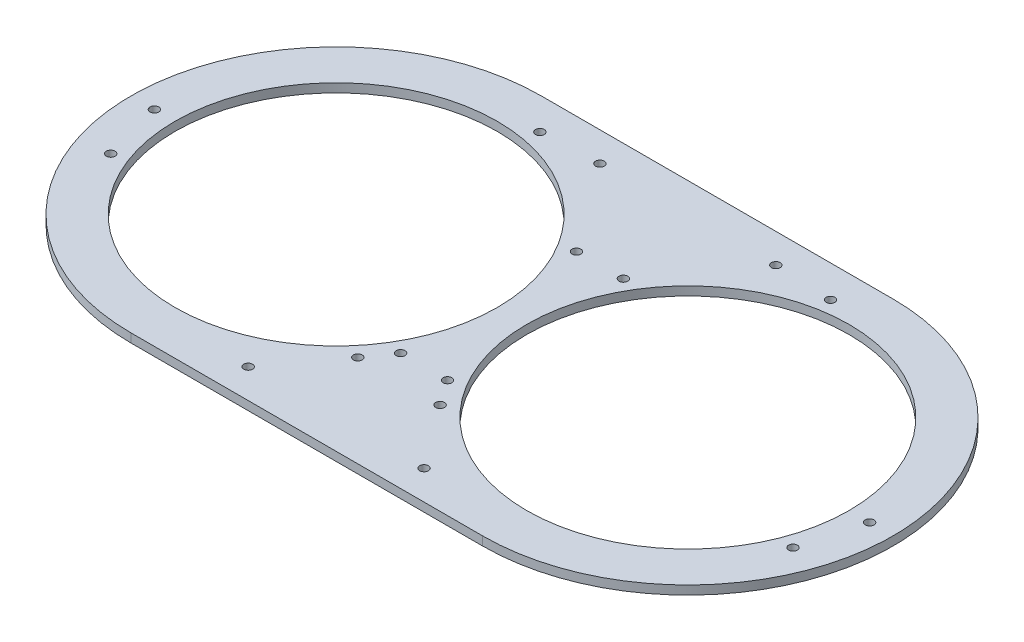
ISO-10303-21;
HEADER;
FILE_DESCRIPTION(('STEP AP214'),'2;1');
FILE_NAME('part.step','',(''),(''),'','','');
FILE_SCHEMA(('AUTOMOTIVE_DESIGN { 1 0 10303 214 1 1 1 1 }'));
ENDSEC;
DATA;
#1=APPLICATION_CONTEXT('core data for automotive mechanical design processes');
#2=APPLICATION_PROTOCOL_DEFINITION('international standard','automotive_design',2000,#1);
#3=PRODUCT_CONTEXT('',#1,'mechanical');
#4=PRODUCT('Part','Part','',(#3));
#5=PRODUCT_RELATED_PRODUCT_CATEGORY('part','',(#4));
#6=PRODUCT_DEFINITION_FORMATION('','',#4);
#7=PRODUCT_DEFINITION_CONTEXT('part definition',#1,'design');
#8=PRODUCT_DEFINITION('design','',#6,#7);
#9=PRODUCT_DEFINITION_SHAPE('','',#8);
#10=(LENGTH_UNIT() NAMED_UNIT(*) SI_UNIT(.MILLI.,.METRE.));
#11=(NAMED_UNIT(*) PLANE_ANGLE_UNIT() SI_UNIT($,.RADIAN.));
#12=(NAMED_UNIT(*) SI_UNIT($,.STERADIAN.) SOLID_ANGLE_UNIT());
#13=UNCERTAINTY_MEASURE_WITH_UNIT(LENGTH_MEASURE(1.E-05),#10,'distance_accuracy_value','');
#14=(GEOMETRIC_REPRESENTATION_CONTEXT(3) GLOBAL_UNCERTAINTY_ASSIGNED_CONTEXT((#13)) GLOBAL_UNIT_ASSIGNED_CONTEXT((#10,
#11,#12)) REPRESENTATION_CONTEXT('',''));
#15=CARTESIAN_POINT('',(0.,0.,0.));
#16=DIRECTION('',(0.,0.,1.));
#17=DIRECTION('',(1.,0.,0.));
#18=AXIS2_PLACEMENT_3D('',#15,#16,#17);
#19=CARTESIAN_POINT('',(0.,3.,70.));
#20=DIRECTION('',(0.,0.,-1.));
#21=DIRECTION('',(-1.,0.,0.));
#22=AXIS2_PLACEMENT_3D('',#19,#20,#21);
#23=PLANE('',#22);
#24=DIRECTION('',(1.,0.,0.));
#25=VECTOR('',#24,1.);
#26=CARTESIAN_POINT('',(0.,0.,70.));
#27=LINE('',#26,#25);
#28=CARTESIAN_POINT('',(-60.,0.,70.));
#29=VERTEX_POINT('',#28);
#30=CARTESIAN_POINT('',(60.,0.,70.));
#31=VERTEX_POINT('',#30);
#32=EDGE_CURVE('E147',#29,#31,#27,.T.);
#33=ORIENTED_EDGE('',*,*,#32,.T.);
#34=DIRECTION('',(0.,-1.,0.));
#35=VECTOR('',#34,1.);
#36=CARTESIAN_POINT('',(60.,3.,70.));
#37=LINE('',#36,#35);
#38=CARTESIAN_POINT('',(60.,3.,70.));
#39=VERTEX_POINT('',#38);
#40=EDGE_CURVE('E11',#39,#31,#37,.T.);
#41=ORIENTED_EDGE('',*,*,#40,.F.);
#42=DIRECTION('',(1.,0.,0.));
#43=VECTOR('',#42,1.);
#44=CARTESIAN_POINT('',(0.,3.,70.));
#45=LINE('',#44,#43);
#46=CARTESIAN_POINT('',(-60.,3.,70.));
#47=VERTEX_POINT('',#46);
#48=EDGE_CURVE('E89',#47,#39,#45,.T.);
#49=ORIENTED_EDGE('',*,*,#48,.F.);
#50=DIRECTION('',(0.,-1.,0.));
#51=VECTOR('',#50,1.);
#52=CARTESIAN_POINT('',(-60.,3.,70.));
#53=LINE('',#52,#51);
#54=EDGE_CURVE('E137',#47,#29,#53,.T.);
#55=ORIENTED_EDGE('',*,*,#54,.T.);
#56=EDGE_LOOP('',(#33,#41,#49,#55));
#57=FACE_BOUND('',#56,.T.);
#58=ADVANCED_FACE('F38',(#57),#23,.F.);
#59=CARTESIAN_POINT('',(60.,3.,0.));
#60=DIRECTION('',(0.,-1.,0.));
#61=DIRECTION('',(0.,0.,-1.));
#62=AXIS2_PLACEMENT_3D('',#59,#60,#61);
#63=CYLINDRICAL_SURFACE('',#62,70.);
#64=CARTESIAN_POINT('',(60.,0.,0.));
#65=DIRECTION('',(0.,1.,0.));
#66=DIRECTION('',(0.,0.,1.));
#67=AXIS2_PLACEMENT_3D('',#64,#65,#66);
#68=CIRCLE('',#67,70.);
#69=CARTESIAN_POINT('',(60.,0.,-70.));
#70=VERTEX_POINT('',#69);
#71=EDGE_CURVE('E94',#31,#70,#68,.T.);
#72=ORIENTED_EDGE('',*,*,#71,.T.);
#73=DIRECTION('',(0.,-1.,0.));
#74=VECTOR('',#73,1.);
#75=CARTESIAN_POINT('',(60.,3.,-70.));
#76=LINE('',#75,#74);
#77=CARTESIAN_POINT('',(60.,3.,-70.));
#78=VERTEX_POINT('',#77);
#79=EDGE_CURVE('E48',#78,#70,#76,.T.);
#80=ORIENTED_EDGE('',*,*,#79,.F.);
#81=CARTESIAN_POINT('',(60.,3.,0.));
#82=DIRECTION('',(0.,1.,0.));
#83=DIRECTION('',(0.,0.,1.));
#84=AXIS2_PLACEMENT_3D('',#81,#82,#83);
#85=CIRCLE('',#84,70.);
#86=EDGE_CURVE('E83',#39,#78,#85,.T.);
#87=ORIENTED_EDGE('',*,*,#86,.F.);
#88=ORIENTED_EDGE('',*,*,#40,.T.);
#89=EDGE_LOOP('',(#72,#80,#87,#88));
#90=FACE_BOUND('',#89,.T.);
#91=ADVANCED_FACE('F93',(#90),#63,.T.);
#92=CARTESIAN_POINT('',(0.,3.,-70.));
#93=DIRECTION('',(0.,0.,-1.));
#94=DIRECTION('',(-1.,0.,0.));
#95=AXIS2_PLACEMENT_3D('',#92,#93,#94);
#96=PLANE('',#95);
#97=DIRECTION('',(1.,0.,0.));
#98=VECTOR('',#97,1.);
#99=CARTESIAN_POINT('',(0.,0.,-70.));
#100=LINE('',#99,#98);
#101=CARTESIAN_POINT('',(-60.,0.,-70.));
#102=VERTEX_POINT('',#101);
#103=EDGE_CURVE('E151',#102,#70,#100,.T.);
#104=ORIENTED_EDGE('',*,*,#103,.F.);
#105=DIRECTION('',(0.,-1.,0.));
#106=VECTOR('',#105,1.);
#107=CARTESIAN_POINT('',(-60.,3.,-70.));
#108=LINE('',#107,#106);
#109=CARTESIAN_POINT('',(-60.,3.,-70.));
#110=VERTEX_POINT('',#109);
#111=EDGE_CURVE('E73',#110,#102,#108,.T.);
#112=ORIENTED_EDGE('',*,*,#111,.F.);
#113=DIRECTION('',(1.,0.,0.));
#114=VECTOR('',#113,1.);
#115=CARTESIAN_POINT('',(0.,3.,-70.));
#116=LINE('',#115,#114);
#117=EDGE_CURVE('E87',#110,#78,#116,.T.);
#118=ORIENTED_EDGE('',*,*,#117,.T.);
#119=ORIENTED_EDGE('',*,*,#79,.T.);
#120=EDGE_LOOP('',(#104,#112,#118,#119));
#121=FACE_BOUND('',#120,.T.);
#122=ADVANCED_FACE('F99',(#121),#96,.T.);
#123=CARTESIAN_POINT('',(14.0373334128611,3.,38.5672565811921));
#124=DIRECTION('',(0.,-1.,0.));
#125=DIRECTION('',(0.,0.,-1.));
#126=AXIS2_PLACEMENT_3D('',#123,#124,#125);
#127=CYLINDRICAL_SURFACE('',#126,1.5);
#128=CARTESIAN_POINT('',(14.0373334128611,3.,38.5672565811921));
#129=DIRECTION('',(0.,1.,0.));
#130=DIRECTION('',(0.,0.,1.));
#131=AXIS2_PLACEMENT_3D('',#128,#129,#130);
#132=CIRCLE('',#131,1.5);
#133=CARTESIAN_POINT('',(14.0373334128611,3.,40.0672565811921));
#134=VERTEX_POINT('',#133);
#135=EDGE_CURVE('E131',#134,#134,#132,.F.);
#136=ORIENTED_EDGE('',*,*,#135,.F.);
#137=EDGE_LOOP('',(#136));
#138=FACE_BOUND('',#137,.T.);
#139=CARTESIAN_POINT('',(14.0373334128611,0.,38.5672565811921));
#140=DIRECTION('',(0.,1.,0.));
#141=DIRECTION('',(0.,0.,1.));
#142=AXIS2_PLACEMENT_3D('',#139,#140,#141);
#143=CIRCLE('',#142,1.5);
#144=CARTESIAN_POINT('',(14.0373334128611,0.,40.0672565811921));
#145=VERTEX_POINT('',#144);
#146=EDGE_CURVE('E181',#145,#145,#143,.F.);
#147=ORIENTED_EDGE('',*,*,#146,.T.);
#148=EDGE_LOOP('',(#147));
#149=FACE_BOUND('',#148,.T.);
#150=ADVANCED_FACE('F286',(#138,#149),#127,.F.);
#151=CARTESIAN_POINT('',(-14.0373334128611,3.,38.5672565811921));
#152=DIRECTION('',(0.,-1.,0.));
#153=DIRECTION('',(0.,0.,-1.));
#154=AXIS2_PLACEMENT_3D('',#151,#152,#153);
#155=CYLINDRICAL_SURFACE('',#154,1.5);
#156=CARTESIAN_POINT('',(-14.0373334128611,3.,38.5672565811921));
#157=DIRECTION('',(0.,1.,0.));
#158=DIRECTION('',(0.,0.,1.));
#159=AXIS2_PLACEMENT_3D('',#156,#157,#158);
#160=CIRCLE('',#159,1.5);
#161=CARTESIAN_POINT('',(-14.0373334128611,3.,40.0672565811921));
#162=VERTEX_POINT('',#161);
#163=EDGE_CURVE('E128',#162,#162,#160,.T.);
#164=ORIENTED_EDGE('',*,*,#163,.T.);
#165=EDGE_LOOP('',(#164));
#166=FACE_BOUND('',#165,.T.);
#167=CARTESIAN_POINT('',(-14.0373334128611,0.,38.5672565811921));
#168=DIRECTION('',(0.,1.,0.));
#169=DIRECTION('',(0.,0.,1.));
#170=AXIS2_PLACEMENT_3D('',#167,#168,#169);
#171=CIRCLE('',#170,1.5);
#172=CARTESIAN_POINT('',(-14.0373334128611,0.,40.0672565811921));
#173=VERTEX_POINT('',#172);
#174=EDGE_CURVE('E178',#173,#173,#171,.T.);
#175=ORIENTED_EDGE('',*,*,#174,.F.);
#176=EDGE_LOOP('',(#175));
#177=FACE_BOUND('',#176,.T.);
#178=ADVANCED_FACE('F289',(#166,#177),#155,.F.);
#179=CARTESIAN_POINT('',(-116.381557247154,3.,20.5212085995402));
#180=DIRECTION('',(0.,-1.,0.));
#181=DIRECTION('',(0.,0.,-1.));
#182=AXIS2_PLACEMENT_3D('',#179,#180,#181);
#183=CYLINDRICAL_SURFACE('',#182,1.5);
#184=CARTESIAN_POINT('',(-116.381557247154,3.,20.5212085995402));
#185=DIRECTION('',(0.,1.,0.));
#186=DIRECTION('',(0.,0.,1.));
#187=AXIS2_PLACEMENT_3D('',#184,#185,#186);
#188=CIRCLE('',#187,1.5);
#189=CARTESIAN_POINT('',(-116.381557247154,3.,22.0212085995402));
#190=VERTEX_POINT('',#189);
#191=EDGE_CURVE('E125',#190,#190,#188,.T.);
#192=ORIENTED_EDGE('',*,*,#191,.T.);
#193=EDGE_LOOP('',(#192));
#194=FACE_BOUND('',#193,.T.);
#195=CARTESIAN_POINT('',(-116.381557247154,0.,20.5212085995402));
#196=DIRECTION('',(0.,1.,0.));
#197=DIRECTION('',(0.,0.,1.));
#198=AXIS2_PLACEMENT_3D('',#195,#196,#197);
#199=CIRCLE('',#198,1.5);
#200=CARTESIAN_POINT('',(-116.381557247154,0.,22.0212085995402));
#201=VERTEX_POINT('',#200);
#202=EDGE_CURVE('E175',#201,#201,#199,.T.);
#203=ORIENTED_EDGE('',*,*,#202,.F.);
#204=EDGE_LOOP('',(#203));
#205=FACE_BOUND('',#204,.T.);
#206=ADVANCED_FACE('F293',(#194,#205),#183,.F.);
#207=CARTESIAN_POINT('',(-49.5811093399839,3.,-59.0884651807324));
#208=DIRECTION('',(0.,-1.,0.));
#209=DIRECTION('',(0.,0.,-1.));
#210=AXIS2_PLACEMENT_3D('',#207,#208,#209);
#211=CYLINDRICAL_SURFACE('',#210,1.5);
#212=CARTESIAN_POINT('',(-49.5811093399839,3.,-59.0884651807324));
#213=DIRECTION('',(0.,1.,0.));
#214=DIRECTION('',(0.,0.,1.));
#215=AXIS2_PLACEMENT_3D('',#212,#213,#214);
#216=CIRCLE('',#215,1.5);
#217=CARTESIAN_POINT('',(-49.5811093399839,3.,-57.5884651807324));
#218=VERTEX_POINT('',#217);
#219=EDGE_CURVE('E122',#218,#218,#216,.T.);
#220=ORIENTED_EDGE('',*,*,#219,.T.);
#221=EDGE_LOOP('',(#220));
#222=FACE_BOUND('',#221,.T.);
#223=CARTESIAN_POINT('',(-49.5811093399839,0.,-59.0884651807324));
#224=DIRECTION('',(0.,1.,0.));
#225=DIRECTION('',(0.,0.,1.));
#226=AXIS2_PLACEMENT_3D('',#223,#224,#225);
#227=CIRCLE('',#226,1.5);
#228=CARTESIAN_POINT('',(-49.5811093399839,0.,-57.5884651807324));
#229=VERTEX_POINT('',#228);
#230=EDGE_CURVE('E172',#229,#229,#227,.T.);
#231=ORIENTED_EDGE('',*,*,#230,.F.);
#232=EDGE_LOOP('',(#231));
#233=FACE_BOUND('',#232,.T.);
#234=ADVANCED_FACE('F297',(#222,#233),#211,.F.);
#235=CARTESIAN_POINT('',(30.,3.,-60.));
#236=DIRECTION('',(0.,-1.,0.));
#237=DIRECTION('',(0.,0.,-1.));
#238=AXIS2_PLACEMENT_3D('',#235,#236,#237);
#239=CYLINDRICAL_SURFACE('',#238,1.5);
#240=CARTESIAN_POINT('',(30.,3.,-60.));
#241=DIRECTION('',(0.,1.,0.));
#242=DIRECTION('',(0.,0.,1.));
#243=AXIS2_PLACEMENT_3D('',#240,#241,#242);
#244=CIRCLE('',#243,1.5);
#245=CARTESIAN_POINT('',(30.,3.,-58.5));
#246=VERTEX_POINT('',#245);
#247=EDGE_CURVE('E119',#246,#246,#244,.F.);
#248=ORIENTED_EDGE('',*,*,#247,.F.);
#249=EDGE_LOOP('',(#248));
#250=FACE_BOUND('',#249,.T.);
#251=CARTESIAN_POINT('',(30.,0.,-60.));
#252=DIRECTION('',(0.,1.,0.));
#253=DIRECTION('',(0.,0.,1.));
#254=AXIS2_PLACEMENT_3D('',#251,#252,#253);
#255=CIRCLE('',#254,1.5);
#256=CARTESIAN_POINT('',(30.,0.,-58.5));
#257=VERTEX_POINT('',#256);
#258=EDGE_CURVE('E169',#257,#257,#255,.F.);
#259=ORIENTED_EDGE('',*,*,#258,.T.);
#260=EDGE_LOOP('',(#259));
#261=FACE_BOUND('',#260,.T.);
#262=ADVANCED_FACE('F301',(#250,#261),#239,.F.);
#263=CARTESIAN_POINT('',(-30.,3.,-60.));
#264=DIRECTION('',(0.,-1.,0.));
#265=DIRECTION('',(0.,0.,-1.));
#266=AXIS2_PLACEMENT_3D('',#263,#264,#265);
#267=CYLINDRICAL_SURFACE('',#266,1.5);
#268=CARTESIAN_POINT('',(-30.,3.,-60.));
#269=DIRECTION('',(0.,1.,0.));
#270=DIRECTION('',(0.,0.,1.));
#271=AXIS2_PLACEMENT_3D('',#268,#269,#270);
#272=CIRCLE('',#271,1.5);
#273=CARTESIAN_POINT('',(-30.,3.,-58.5));
#274=VERTEX_POINT('',#273);
#275=EDGE_CURVE('E116',#274,#274,#272,.T.);
#276=ORIENTED_EDGE('',*,*,#275,.T.);
#277=EDGE_LOOP('',(#276));
#278=FACE_BOUND('',#277,.T.);
#279=CARTESIAN_POINT('',(-30.,0.,-60.));
#280=DIRECTION('',(0.,1.,0.));
#281=DIRECTION('',(0.,0.,1.));
#282=AXIS2_PLACEMENT_3D('',#279,#280,#281);
#283=CIRCLE('',#282,1.5);
#284=CARTESIAN_POINT('',(-30.,0.,-58.5));
#285=VERTEX_POINT('',#284);
#286=EDGE_CURVE('E166',#285,#285,#283,.T.);
#287=ORIENTED_EDGE('',*,*,#286,.F.);
#288=EDGE_LOOP('',(#287));
#289=FACE_BOUND('',#288,.T.);
#290=ADVANCED_FACE('F305',(#278,#289),#267,.F.);
#291=CARTESIAN_POINT('',(122.,3.,0.));
#292=DIRECTION('',(0.,-1.,0.));
#293=DIRECTION('',(0.,0.,-1.));
#294=AXIS2_PLACEMENT_3D('',#291,#292,#293);
#295=CYLINDRICAL_SURFACE('',#294,1.5);
#296=CARTESIAN_POINT('',(122.,3.,0.));
#297=DIRECTION('',(0.,1.,0.));
#298=DIRECTION('',(0.,0.,1.));
#299=AXIS2_PLACEMENT_3D('',#296,#297,#298);
#300=CIRCLE('',#299,1.5);
#301=CARTESIAN_POINT('',(122.,3.,1.5));
#302=VERTEX_POINT('',#301);
#303=EDGE_CURVE('E113',#302,#302,#300,.T.);
#304=ORIENTED_EDGE('',*,*,#303,.T.);
#305=EDGE_LOOP('',(#304));
#306=FACE_BOUND('',#305,.T.);
#307=CARTESIAN_POINT('',(122.,0.,0.));
#308=DIRECTION('',(0.,1.,0.));
#309=DIRECTION('',(0.,0.,1.));
#310=AXIS2_PLACEMENT_3D('',#307,#308,#309);
#311=CIRCLE('',#310,1.5);
#312=CARTESIAN_POINT('',(122.,0.,1.5));
#313=VERTEX_POINT('',#312);
#314=EDGE_CURVE('E163',#313,#313,#311,.T.);
#315=ORIENTED_EDGE('',*,*,#314,.F.);
#316=EDGE_LOOP('',(#315));
#317=FACE_BOUND('',#316,.T.);
#318=ADVANCED_FACE('F309',(#306,#317),#295,.F.);
#319=CARTESIAN_POINT('',(-122.,3.,0.));
#320=DIRECTION('',(0.,-1.,0.));
#321=DIRECTION('',(0.,0.,-1.));
#322=AXIS2_PLACEMENT_3D('',#319,#320,#321);
#323=CYLINDRICAL_SURFACE('',#322,1.5);
#324=CARTESIAN_POINT('',(-122.,3.,0.));
#325=DIRECTION('',(0.,1.,0.));
#326=DIRECTION('',(0.,0.,1.));
#327=AXIS2_PLACEMENT_3D('',#324,#325,#326);
#328=CIRCLE('',#327,1.5);
#329=CARTESIAN_POINT('',(-122.,3.,1.5));
#330=VERTEX_POINT('',#329);
#331=EDGE_CURVE('E110',#330,#330,#328,.T.);
#332=ORIENTED_EDGE('',*,*,#331,.T.);
#333=EDGE_LOOP('',(#332));
#334=FACE_BOUND('',#333,.T.);
#335=CARTESIAN_POINT('',(-122.,0.,0.));
#336=DIRECTION('',(0.,1.,0.));
#337=DIRECTION('',(0.,0.,1.));
#338=AXIS2_PLACEMENT_3D('',#335,#336,#337);
#339=CIRCLE('',#338,1.5);
#340=CARTESIAN_POINT('',(-122.,0.,1.5));
#341=VERTEX_POINT('',#340);
#342=EDGE_CURVE('E160',#341,#341,#339,.T.);
#343=ORIENTED_EDGE('',*,*,#342,.F.);
#344=EDGE_LOOP('',(#343));
#345=FACE_BOUND('',#344,.T.);
#346=ADVANCED_FACE('F313',(#334,#345),#323,.F.);
#347=CARTESIAN_POINT('',(60.,3.,0.));
#348=DIRECTION('',(0.,-1.,0.));
#349=DIRECTION('',(0.,0.,-1.));
#350=AXIS2_PLACEMENT_3D('',#347,#348,#349);
#351=CYLINDRICAL_SURFACE('',#350,55.);
#352=CARTESIAN_POINT('',(60.,3.,0.));
#353=DIRECTION('',(0.,1.,0.));
#354=DIRECTION('',(0.,0.,1.));
#355=AXIS2_PLACEMENT_3D('',#352,#353,#354);
#356=CIRCLE('',#355,55.);
#357=CARTESIAN_POINT('',(60.,3.,55.));
#358=VERTEX_POINT('',#357);
#359=EDGE_CURVE('E107',#358,#358,#356,.F.);
#360=ORIENTED_EDGE('',*,*,#359,.F.);
#361=EDGE_LOOP('',(#360));
#362=FACE_BOUND('',#361,.T.);
#363=CARTESIAN_POINT('',(60.,0.,0.));
#364=DIRECTION('',(0.,1.,0.));
#365=DIRECTION('',(0.,0.,1.));
#366=AXIS2_PLACEMENT_3D('',#363,#364,#365);
#367=CIRCLE('',#366,55.);
#368=CARTESIAN_POINT('',(60.,0.,55.));
#369=VERTEX_POINT('',#368);
#370=EDGE_CURVE('E157',#369,#369,#367,.F.);
#371=ORIENTED_EDGE('',*,*,#370,.T.);
#372=EDGE_LOOP('',(#371));
#373=FACE_BOUND('',#372,.T.);
#374=ADVANCED_FACE('F317',(#362,#373),#351,.F.);
#375=CARTESIAN_POINT('',(-60.,3.,0.));
#376=DIRECTION('',(0.,-1.,0.));
#377=DIRECTION('',(0.,0.,-1.));
#378=AXIS2_PLACEMENT_3D('',#375,#376,#377);
#379=CYLINDRICAL_SURFACE('',#378,55.);
#380=CARTESIAN_POINT('',(-60.,3.,0.));
#381=DIRECTION('',(0.,1.,0.));
#382=DIRECTION('',(0.,0.,1.));
#383=AXIS2_PLACEMENT_3D('',#380,#381,#382);
#384=CIRCLE('',#383,55.);
#385=CARTESIAN_POINT('',(-60.,3.,55.));
#386=VERTEX_POINT('',#385);
#387=EDGE_CURVE('E101',#386,#386,#384,.T.);
#388=ORIENTED_EDGE('',*,*,#387,.T.);
#389=EDGE_LOOP('',(#388));
#390=FACE_BOUND('',#389,.T.);
#391=CARTESIAN_POINT('',(-60.,0.,0.));
#392=DIRECTION('',(0.,1.,0.));
#393=DIRECTION('',(0.,0.,1.));
#394=AXIS2_PLACEMENT_3D('',#391,#392,#393);
#395=CIRCLE('',#394,55.);
#396=CARTESIAN_POINT('',(-60.,0.,55.));
#397=VERTEX_POINT('',#396);
#398=EDGE_CURVE('E154',#397,#397,#395,.T.);
#399=ORIENTED_EDGE('',*,*,#398,.F.);
#400=EDGE_LOOP('',(#399));
#401=FACE_BOUND('',#400,.T.);
#402=ADVANCED_FACE('F321',(#390,#401),#379,.F.);
#403=CARTESIAN_POINT('',(-60.,3.,0.));
#404=DIRECTION('',(0.,-1.,0.));
#405=DIRECTION('',(0.,0.,-1.));
#406=AXIS2_PLACEMENT_3D('',#403,#404,#405);
#407=CYLINDRICAL_SURFACE('',#406,70.);
#408=CARTESIAN_POINT('',(-60.,0.,0.));
#409=DIRECTION('',(0.,1.,0.));
#410=DIRECTION('',(0.,0.,1.));
#411=AXIS2_PLACEMENT_3D('',#408,#409,#410);
#412=CIRCLE('',#411,70.);
#413=EDGE_CURVE('E76',#102,#29,#412,.T.);
#414=ORIENTED_EDGE('',*,*,#413,.T.);
#415=ORIENTED_EDGE('',*,*,#54,.F.);
#416=CARTESIAN_POINT('',(-60.,3.,0.));
#417=DIRECTION('',(0.,1.,0.));
#418=DIRECTION('',(0.,0.,1.));
#419=AXIS2_PLACEMENT_3D('',#416,#417,#418);
#420=CIRCLE('',#419,70.);
#421=EDGE_CURVE('E57',#110,#47,#420,.T.);
#422=ORIENTED_EDGE('',*,*,#421,.F.);
#423=ORIENTED_EDGE('',*,*,#111,.T.);
#424=EDGE_LOOP('',(#414,#415,#422,#423));
#425=FACE_BOUND('',#424,.T.);
#426=ADVANCED_FACE('F230',(#425),#407,.T.);
#427=CARTESIAN_POINT('',(30.,3.,60.));
#428=DIRECTION('',(0.,-1.,0.));
#429=DIRECTION('',(0.,0.,-1.));
#430=AXIS2_PLACEMENT_3D('',#427,#428,#429);
#431=CYLINDRICAL_SURFACE('',#430,1.5);
#432=CARTESIAN_POINT('',(30.,3.,60.));
#433=DIRECTION('',(0.,1.,0.));
#434=DIRECTION('',(0.,0.,1.));
#435=AXIS2_PLACEMENT_3D('',#432,#433,#434);
#436=CIRCLE('',#435,1.5);
#437=CARTESIAN_POINT('',(30.,3.,61.5));
#438=VERTEX_POINT('',#437);
#439=EDGE_CURVE('E457',#438,#438,#436,.T.);
#440=ORIENTED_EDGE('',*,*,#439,.T.);
#441=EDGE_LOOP('',(#440));
#442=FACE_BOUND('',#441,.T.);
#443=CARTESIAN_POINT('',(30.,0.,60.));
#444=DIRECTION('',(0.,1.,0.));
#445=DIRECTION('',(0.,0.,1.));
#446=AXIS2_PLACEMENT_3D('',#443,#444,#445);
#447=CIRCLE('',#446,1.5);
#448=CARTESIAN_POINT('',(30.,0.,61.5));
#449=VERTEX_POINT('',#448);
#450=EDGE_CURVE('E144',#449,#449,#447,.T.);
#451=ORIENTED_EDGE('',*,*,#450,.F.);
#452=EDGE_LOOP('',(#451));
#453=FACE_BOUND('',#452,.T.);
#454=ADVANCED_FACE('F227',(#442,#453),#431,.F.);
#455=CARTESIAN_POINT('',(-30.,3.,60.));
#456=DIRECTION('',(0.,-1.,0.));
#457=DIRECTION('',(0.,0.,-1.));
#458=AXIS2_PLACEMENT_3D('',#455,#456,#457);
#459=CYLINDRICAL_SURFACE('',#458,1.5);
#460=CARTESIAN_POINT('',(-30.,3.,60.));
#461=DIRECTION('',(0.,1.,0.));
#462=DIRECTION('',(0.,0.,1.));
#463=AXIS2_PLACEMENT_3D('',#460,#461,#462);
#464=CIRCLE('',#463,1.5);
#465=CARTESIAN_POINT('',(-30.,3.,61.5));
#466=VERTEX_POINT('',#465);
#467=EDGE_CURVE('E242',#466,#466,#464,.F.);
#468=ORIENTED_EDGE('',*,*,#467,.F.);
#469=EDGE_LOOP('',(#468));
#470=FACE_BOUND('',#469,.T.);
#471=CARTESIAN_POINT('',(-30.,0.,60.));
#472=DIRECTION('',(0.,1.,0.));
#473=DIRECTION('',(0.,0.,1.));
#474=AXIS2_PLACEMENT_3D('',#471,#472,#473);
#475=CIRCLE('',#474,1.5);
#476=CARTESIAN_POINT('',(-30.,0.,61.5));
#477=VERTEX_POINT('',#476);
#478=EDGE_CURVE('E141',#477,#477,#475,.F.);
#479=ORIENTED_EDGE('',*,*,#478,.T.);
#480=EDGE_LOOP('',(#479));
#481=FACE_BOUND('',#480,.T.);
#482=ADVANCED_FACE('F229',(#470,#481),#459,.F.);
#483=CARTESIAN_POINT('',(116.381557247154,3.,20.5212085995402));
#484=DIRECTION('',(0.,-1.,0.));
#485=DIRECTION('',(0.,0.,-1.));
#486=AXIS2_PLACEMENT_3D('',#483,#484,#485);
#487=CYLINDRICAL_SURFACE('',#486,1.5);
#488=CARTESIAN_POINT('',(116.381557247154,3.,20.5212085995402));
#489=DIRECTION('',(0.,1.,0.));
#490=DIRECTION('',(0.,0.,1.));
#491=AXIS2_PLACEMENT_3D('',#488,#489,#490);
#492=CIRCLE('',#491,1.5);
#493=CARTESIAN_POINT('',(116.381557247154,3.,22.0212085995402));
#494=VERTEX_POINT('',#493);
#495=EDGE_CURVE('E187',#494,#494,#492,.F.);
#496=ORIENTED_EDGE('',*,*,#495,.F.);
#497=EDGE_LOOP('',(#496));
#498=FACE_BOUND('',#497,.T.);
#499=CARTESIAN_POINT('',(116.381557247154,0.,20.5212085995402));
#500=DIRECTION('',(0.,1.,0.));
#501=DIRECTION('',(0.,0.,1.));
#502=AXIS2_PLACEMENT_3D('',#499,#500,#501);
#503=CIRCLE('',#502,1.5);
#504=CARTESIAN_POINT('',(116.381557247154,0.,22.0212085995402));
#505=VERTEX_POINT('',#504);
#506=EDGE_CURVE('E138',#505,#505,#503,.F.);
#507=ORIENTED_EDGE('',*,*,#506,.T.);
#508=EDGE_LOOP('',(#507));
#509=FACE_BOUND('',#508,.T.);
#510=ADVANCED_FACE('F40',(#498,#509),#487,.F.);
#511=CARTESIAN_POINT('',(49.5811093399839,3.,-59.0884651807324));
#512=DIRECTION('',(0.,-1.,0.));
#513=DIRECTION('',(0.,0.,-1.));
#514=AXIS2_PLACEMENT_3D('',#511,#512,#513);
#515=CYLINDRICAL_SURFACE('',#514,1.5);
#516=CARTESIAN_POINT('',(49.5811093399839,3.,-59.0884651807324));
#517=DIRECTION('',(0.,1.,0.));
#518=DIRECTION('',(0.,0.,1.));
#519=AXIS2_PLACEMENT_3D('',#516,#517,#518);
#520=CIRCLE('',#519,1.5);
#521=CARTESIAN_POINT('',(49.5811093399839,3.,-57.5884651807324));
#522=VERTEX_POINT('',#521);
#523=EDGE_CURVE('E134',#522,#522,#520,.F.);
#524=ORIENTED_EDGE('',*,*,#523,.F.);
#525=EDGE_LOOP('',(#524));
#526=FACE_BOUND('',#525,.T.);
#527=CARTESIAN_POINT('',(49.5811093399839,0.,-59.0884651807324));
#528=DIRECTION('',(0.,1.,0.));
#529=DIRECTION('',(0.,0.,1.));
#530=AXIS2_PLACEMENT_3D('',#527,#528,#529);
#531=CIRCLE('',#530,1.5);
#532=CARTESIAN_POINT('',(49.5811093399839,0.,-57.5884651807324));
#533=VERTEX_POINT('',#532);
#534=EDGE_CURVE('E184',#533,#533,#531,.F.);
#535=ORIENTED_EDGE('',*,*,#534,.T.);
#536=EDGE_LOOP('',(#535));
#537=FACE_BOUND('',#536,.T.);
#538=ADVANCED_FACE('F237',(#526,#537),#515,.F.);
#539=CARTESIAN_POINT('',(0.,3.,0.));
#540=DIRECTION('',(0.,1.,0.));
#541=DIRECTION('',(0.,0.,1.));
#542=AXIS2_PLACEMENT_3D('',#539,#540,#541);
#543=PLANE('',#542);
#544=CARTESIAN_POINT('',(-8.,3.,-30.));
#545=DIRECTION('',(0.,1.,0.));
#546=DIRECTION('',(0.,0.,-1.));
#547=AXIS2_PLACEMENT_3D('',#544,#545,#546);
#548=CIRCLE('',#547,1.5);
#549=CARTESIAN_POINT('',(-8.,3.,-31.5));
#550=VERTEX_POINT('',#549);
#551=EDGE_CURVE('E450',#550,#550,#548,.T.);
#552=ORIENTED_EDGE('',*,*,#551,.F.);
#553=EDGE_LOOP('',(#552));
#554=FACE_BOUND('',#553,.T.);
#555=CARTESIAN_POINT('',(8.,3.,-30.));
#556=DIRECTION('',(0.,1.,0.));
#557=DIRECTION('',(0.,0.,1.));
#558=AXIS2_PLACEMENT_3D('',#555,#556,#557);
#559=CIRCLE('',#558,1.5);
#560=CARTESIAN_POINT('',(8.,3.,-28.5));
#561=VERTEX_POINT('',#560);
#562=EDGE_CURVE('E445',#561,#561,#559,.T.);
#563=ORIENTED_EDGE('',*,*,#562,.F.);
#564=EDGE_LOOP('',(#563));
#565=FACE_BOUND('',#564,.T.);
#566=CARTESIAN_POINT('',(8.,3.,30.));
#567=DIRECTION('',(0.,1.,0.));
#568=DIRECTION('',(0.,0.,-1.));
#569=AXIS2_PLACEMENT_3D('',#566,#567,#568);
#570=CIRCLE('',#569,1.5);
#571=CARTESIAN_POINT('',(8.,3.,28.5));
#572=VERTEX_POINT('',#571);
#573=EDGE_CURVE('E435',#572,#572,#570,.T.);
#574=ORIENTED_EDGE('',*,*,#573,.F.);
#575=EDGE_LOOP('',(#574));
#576=FACE_BOUND('',#575,.T.);
#577=CARTESIAN_POINT('',(-8.,3.,30.));
#578=DIRECTION('',(0.,1.,0.));
#579=DIRECTION('',(0.,0.,1.));
#580=AXIS2_PLACEMENT_3D('',#577,#578,#579);
#581=CIRCLE('',#580,1.5);
#582=CARTESIAN_POINT('',(-8.,3.,31.5));
#583=VERTEX_POINT('',#582);
#584=EDGE_CURVE('E194',#583,#583,#581,.T.);
#585=ORIENTED_EDGE('',*,*,#584,.F.);
#586=EDGE_LOOP('',(#585));
#587=FACE_BOUND('',#586,.T.);
#588=ORIENTED_EDGE('',*,*,#495,.T.);
#589=EDGE_LOOP('',(#588));
#590=FACE_BOUND('',#589,.T.);
#591=ORIENTED_EDGE('',*,*,#467,.T.);
#592=EDGE_LOOP('',(#591));
#593=FACE_BOUND('',#592,.T.);
#594=ORIENTED_EDGE('',*,*,#439,.F.);
#595=EDGE_LOOP('',(#594));
#596=FACE_BOUND('',#595,.T.);
#597=ORIENTED_EDGE('',*,*,#48,.T.);
#598=ORIENTED_EDGE('',*,*,#86,.T.);
#599=ORIENTED_EDGE('',*,*,#117,.F.);
#600=ORIENTED_EDGE('',*,*,#421,.T.);
#601=EDGE_LOOP('',(#597,#598,#599,#600));
#602=FACE_BOUND('',#601,.T.);
#603=ORIENTED_EDGE('',*,*,#387,.F.);
#604=EDGE_LOOP('',(#603));
#605=FACE_BOUND('',#604,.T.);
#606=ORIENTED_EDGE('',*,*,#359,.T.);
#607=EDGE_LOOP('',(#606));
#608=FACE_BOUND('',#607,.T.);
#609=ORIENTED_EDGE('',*,*,#331,.F.);
#610=EDGE_LOOP('',(#609));
#611=FACE_BOUND('',#610,.T.);
#612=ORIENTED_EDGE('',*,*,#303,.F.);
#613=EDGE_LOOP('',(#612));
#614=FACE_BOUND('',#613,.T.);
#615=ORIENTED_EDGE('',*,*,#275,.F.);
#616=EDGE_LOOP('',(#615));
#617=FACE_BOUND('',#616,.T.);
#618=ORIENTED_EDGE('',*,*,#247,.T.);
#619=EDGE_LOOP('',(#618));
#620=FACE_BOUND('',#619,.T.);
#621=ORIENTED_EDGE('',*,*,#219,.F.);
#622=EDGE_LOOP('',(#621));
#623=FACE_BOUND('',#622,.T.);
#624=ORIENTED_EDGE('',*,*,#191,.F.);
#625=EDGE_LOOP('',(#624));
#626=FACE_BOUND('',#625,.T.);
#627=ORIENTED_EDGE('',*,*,#163,.F.);
#628=EDGE_LOOP('',(#627));
#629=FACE_BOUND('',#628,.T.);
#630=ORIENTED_EDGE('',*,*,#135,.T.);
#631=EDGE_LOOP('',(#630));
#632=FACE_BOUND('',#631,.T.);
#633=ORIENTED_EDGE('',*,*,#523,.T.);
#634=EDGE_LOOP('',(#633));
#635=FACE_BOUND('',#634,.T.);
#636=ADVANCED_FACE('F84',(#554,#565,#576,#587,#590,#593,#596,#602,#605,#608,#611,#614,#617,#620,
#623,#626,#629,#632,#635),#543,.T.);
#637=CARTESIAN_POINT('',(0.,0.,0.));
#638=DIRECTION('',(0.,1.,0.));
#639=DIRECTION('',(0.,0.,1.));
#640=AXIS2_PLACEMENT_3D('',#637,#638,#639);
#641=PLANE('',#640);
#642=CARTESIAN_POINT('',(-8.,0.,-30.));
#643=DIRECTION('',(0.,1.,0.));
#644=DIRECTION('',(0.,0.,1.));
#645=AXIS2_PLACEMENT_3D('',#642,#643,#644);
#646=CIRCLE('',#645,1.5);
#647=CARTESIAN_POINT('',(-8.,0.,-28.5));
#648=VERTEX_POINT('',#647);
#649=EDGE_CURVE('E42',#648,#648,#646,.T.);
#650=ORIENTED_EDGE('',*,*,#649,.T.);
#651=EDGE_LOOP('',(#650));
#652=FACE_BOUND('',#651,.T.);
#653=CARTESIAN_POINT('',(8.,0.,-30.));
#654=DIRECTION('',(0.,1.,0.));
#655=DIRECTION('',(0.,0.,1.));
#656=AXIS2_PLACEMENT_3D('',#653,#654,#655);
#657=CIRCLE('',#656,1.5);
#658=CARTESIAN_POINT('',(8.,0.,-28.5));
#659=VERTEX_POINT('',#658);
#660=EDGE_CURVE('E196',#659,#659,#657,.T.);
#661=ORIENTED_EDGE('',*,*,#660,.T.);
#662=EDGE_LOOP('',(#661));
#663=FACE_BOUND('',#662,.T.);
#664=CARTESIAN_POINT('',(8.,0.,30.));
#665=DIRECTION('',(0.,1.,0.));
#666=DIRECTION('',(0.,0.,1.));
#667=AXIS2_PLACEMENT_3D('',#664,#665,#666);
#668=CIRCLE('',#667,1.5);
#669=CARTESIAN_POINT('',(8.,0.,31.5));
#670=VERTEX_POINT('',#669);
#671=EDGE_CURVE('E193',#670,#670,#668,.T.);
#672=ORIENTED_EDGE('',*,*,#671,.T.);
#673=EDGE_LOOP('',(#672));
#674=FACE_BOUND('',#673,.T.);
#675=CARTESIAN_POINT('',(-8.,0.,30.));
#676=DIRECTION('',(0.,1.,0.));
#677=DIRECTION('',(0.,0.,1.));
#678=AXIS2_PLACEMENT_3D('',#675,#676,#677);
#679=CIRCLE('',#678,1.5);
#680=CARTESIAN_POINT('',(-8.,0.,31.5));
#681=VERTEX_POINT('',#680);
#682=EDGE_CURVE('E190',#681,#681,#679,.T.);
#683=ORIENTED_EDGE('',*,*,#682,.T.);
#684=EDGE_LOOP('',(#683));
#685=FACE_BOUND('',#684,.T.);
#686=ORIENTED_EDGE('',*,*,#506,.F.);
#687=EDGE_LOOP('',(#686));
#688=FACE_BOUND('',#687,.T.);
#689=ORIENTED_EDGE('',*,*,#478,.F.);
#690=EDGE_LOOP('',(#689));
#691=FACE_BOUND('',#690,.T.);
#692=ORIENTED_EDGE('',*,*,#450,.T.);
#693=EDGE_LOOP('',(#692));
#694=FACE_BOUND('',#693,.T.);
#695=ORIENTED_EDGE('',*,*,#32,.F.);
#696=ORIENTED_EDGE('',*,*,#413,.F.);
#697=ORIENTED_EDGE('',*,*,#103,.T.);
#698=ORIENTED_EDGE('',*,*,#71,.F.);
#699=EDGE_LOOP('',(#695,#696,#697,#698));
#700=FACE_BOUND('',#699,.T.);
#701=ORIENTED_EDGE('',*,*,#398,.T.);
#702=EDGE_LOOP('',(#701));
#703=FACE_BOUND('',#702,.T.);
#704=ORIENTED_EDGE('',*,*,#370,.F.);
#705=EDGE_LOOP('',(#704));
#706=FACE_BOUND('',#705,.T.);
#707=ORIENTED_EDGE('',*,*,#342,.T.);
#708=EDGE_LOOP('',(#707));
#709=FACE_BOUND('',#708,.T.);
#710=ORIENTED_EDGE('',*,*,#314,.T.);
#711=EDGE_LOOP('',(#710));
#712=FACE_BOUND('',#711,.T.);
#713=ORIENTED_EDGE('',*,*,#286,.T.);
#714=EDGE_LOOP('',(#713));
#715=FACE_BOUND('',#714,.T.);
#716=ORIENTED_EDGE('',*,*,#258,.F.);
#717=EDGE_LOOP('',(#716));
#718=FACE_BOUND('',#717,.T.);
#719=ORIENTED_EDGE('',*,*,#230,.T.);
#720=EDGE_LOOP('',(#719));
#721=FACE_BOUND('',#720,.T.);
#722=ORIENTED_EDGE('',*,*,#202,.T.);
#723=EDGE_LOOP('',(#722));
#724=FACE_BOUND('',#723,.T.);
#725=ORIENTED_EDGE('',*,*,#174,.T.);
#726=EDGE_LOOP('',(#725));
#727=FACE_BOUND('',#726,.T.);
#728=ORIENTED_EDGE('',*,*,#146,.F.);
#729=EDGE_LOOP('',(#728));
#730=FACE_BOUND('',#729,.T.);
#731=ORIENTED_EDGE('',*,*,#534,.F.);
#732=EDGE_LOOP('',(#731));
#733=FACE_BOUND('',#732,.T.);
#734=ADVANCED_FACE('F203',(#652,#663,#674,#685,#688,#691,#694,#700,#703,#706,#709,#712,#715,
#718,#721,#724,#727,#730,#733),#641,.F.);
#735=CARTESIAN_POINT('',(-8.,-7.,30.));
#736=DIRECTION('',(0.,1.,0.));
#737=DIRECTION('',(0.,0.,1.));
#738=AXIS2_PLACEMENT_3D('',#735,#736,#737);
#739=CYLINDRICAL_SURFACE('',#738,1.5);
#740=ORIENTED_EDGE('',*,*,#584,.T.);
#741=EDGE_LOOP('',(#740));
#742=FACE_BOUND('',#741,.T.);
#743=ORIENTED_EDGE('',*,*,#682,.F.);
#744=EDGE_LOOP('',(#743));
#745=FACE_BOUND('',#744,.T.);
#746=ADVANCED_FACE('F247',(#742,#745),#739,.F.);
#747=CARTESIAN_POINT('',(8.,-7.,30.));
#748=DIRECTION('',(0.,1.,0.));
#749=DIRECTION('',(0.,0.,1.));
#750=AXIS2_PLACEMENT_3D('',#747,#748,#749);
#751=CYLINDRICAL_SURFACE('',#750,1.5);
#752=ORIENTED_EDGE('',*,*,#573,.T.);
#753=EDGE_LOOP('',(#752));
#754=FACE_BOUND('',#753,.T.);
#755=ORIENTED_EDGE('',*,*,#671,.F.);
#756=EDGE_LOOP('',(#755));
#757=FACE_BOUND('',#756,.T.);
#758=ADVANCED_FACE('F213',(#754,#757),#751,.F.);
#759=CARTESIAN_POINT('',(8.,-7.,-30.));
#760=DIRECTION('',(0.,1.,0.));
#761=DIRECTION('',(0.,0.,1.));
#762=AXIS2_PLACEMENT_3D('',#759,#760,#761);
#763=CYLINDRICAL_SURFACE('',#762,1.5);
#764=ORIENTED_EDGE('',*,*,#562,.T.);
#765=EDGE_LOOP('',(#764));
#766=FACE_BOUND('',#765,.T.);
#767=ORIENTED_EDGE('',*,*,#660,.F.);
#768=EDGE_LOOP('',(#767));
#769=FACE_BOUND('',#768,.T.);
#770=ADVANCED_FACE('F207',(#766,#769),#763,.F.);
#771=CARTESIAN_POINT('',(-8.,-7.,-30.));
#772=DIRECTION('',(0.,1.,0.));
#773=DIRECTION('',(0.,0.,1.));
#774=AXIS2_PLACEMENT_3D('',#771,#772,#773);
#775=CYLINDRICAL_SURFACE('',#774,1.5);
#776=ORIENTED_EDGE('',*,*,#551,.T.);
#777=EDGE_LOOP('',(#776));
#778=FACE_BOUND('',#777,.T.);
#779=ORIENTED_EDGE('',*,*,#649,.F.);
#780=EDGE_LOOP('',(#779));
#781=FACE_BOUND('',#780,.T.);
#782=ADVANCED_FACE('F205',(#778,#781),#775,.F.);
#783=CLOSED_SHELL('',(#58,#91,#122,#150,#178,#206,#234,#262,#290,#318,#346,#374,#402,#426,#454,
#482,#510,#538,#636,#734,#746,#758,#770,#782));
#784=MANIFOLD_SOLID_BREP('B2',#783);
#785=ADVANCED_BREP_SHAPE_REPRESENTATION('',(#18,#784),#14);
#786=SHAPE_DEFINITION_REPRESENTATION(#9,#785);
ENDSEC;
END-ISO-10303-21;
